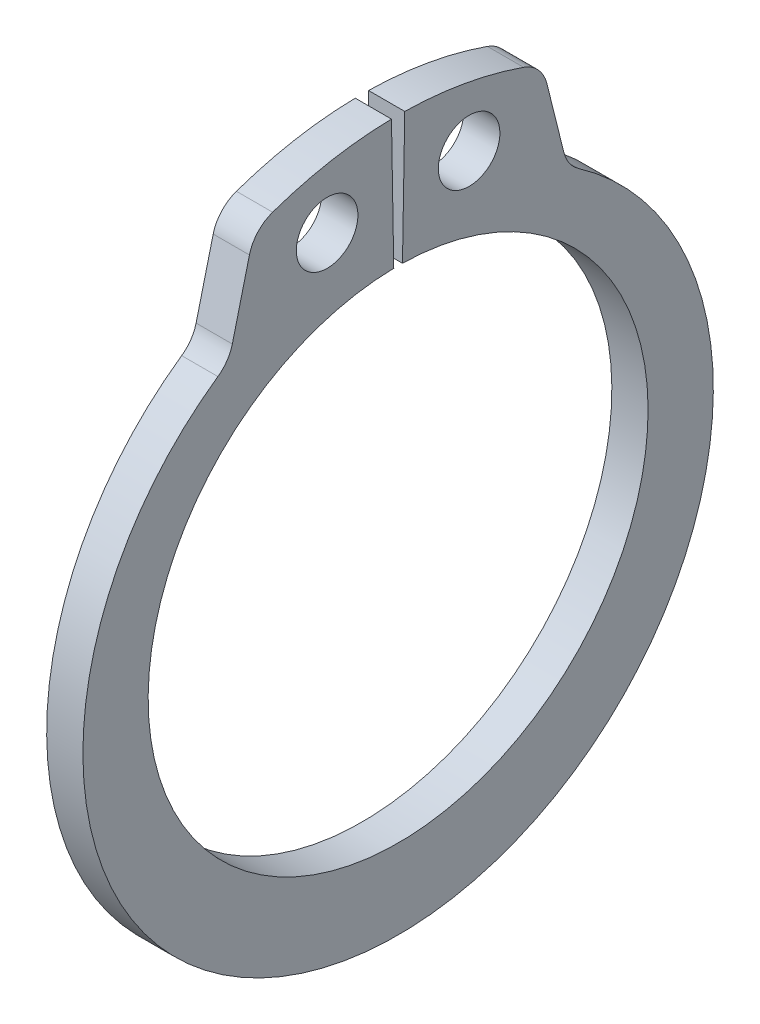
ISO-10303-21;
HEADER;
FILE_DESCRIPTION(('STEP AP214'),'2;1');
FILE_NAME('part.step','',(''),(''),'','','');
FILE_SCHEMA(('AUTOMOTIVE_DESIGN { 1 0 10303 214 1 1 1 1 }'));
ENDSEC;
DATA;
#1=APPLICATION_CONTEXT('core data for automotive mechanical design processes');
#2=APPLICATION_PROTOCOL_DEFINITION('international standard','automotive_design',2000,#1);
#3=PRODUCT_CONTEXT('',#1,'mechanical');
#4=PRODUCT('Part','Part','',(#3));
#5=PRODUCT_RELATED_PRODUCT_CATEGORY('part','',(#4));
#6=PRODUCT_DEFINITION_FORMATION('','',#4);
#7=PRODUCT_DEFINITION_CONTEXT('part definition',#1,'design');
#8=PRODUCT_DEFINITION('design','',#6,#7);
#9=PRODUCT_DEFINITION_SHAPE('','',#8);
#10=(LENGTH_UNIT() NAMED_UNIT(*) SI_UNIT(.MILLI.,.METRE.));
#11=(NAMED_UNIT(*) PLANE_ANGLE_UNIT() SI_UNIT($,.RADIAN.));
#12=(NAMED_UNIT(*) SI_UNIT($,.STERADIAN.) SOLID_ANGLE_UNIT());
#13=UNCERTAINTY_MEASURE_WITH_UNIT(LENGTH_MEASURE(1.E-05),#10,'distance_accuracy_value','');
#14=(GEOMETRIC_REPRESENTATION_CONTEXT(3) GLOBAL_UNCERTAINTY_ASSIGNED_CONTEXT((#13)) GLOBAL_UNIT_ASSIGNED_CONTEXT((#10,
#11,#12)) REPRESENTATION_CONTEXT('',''));
#15=CARTESIAN_POINT('',(0.,0.,0.));
#16=DIRECTION('',(0.,0.,1.));
#17=DIRECTION('',(1.,0.,0.));
#18=AXIS2_PLACEMENT_3D('',#15,#16,#17);
#19=CARTESIAN_POINT('',(-0.5,0.,0.));
#20=DIRECTION('',(1.,0.,0.));
#21=DIRECTION('',(0.,1.,0.));
#22=AXIS2_PLACEMENT_3D('',#19,#20,#21);
#23=PLANE('',#22);
#24=CARTESIAN_POINT('',(-0.5,8.66711980549087,-1.9596288316201));
#25=DIRECTION('',(-1.,0.,0.));
#26=DIRECTION('',(0.,-1.,0.));
#27=AXIS2_PLACEMENT_3D('',#24,#25,#26);
#28=CIRCLE('',#27,0.850000000000001);
#29=CARTESIAN_POINT('',(-0.5,7.81711980549087,-1.9596288316201));
#30=VERTEX_POINT('',#29);
#31=EDGE_CURVE('E125',#30,#30,#28,.F.);
#32=ORIENTED_EDGE('',*,*,#31,.T.);
#33=EDGE_LOOP('',(#32));
#34=FACE_BOUND('',#33,.T.);
#35=CARTESIAN_POINT('',(-0.5,8.96816184312503,3.13401869099665));
#36=DIRECTION('',(-1.,0.,0.));
#37=DIRECTION('',(0.,-1.,0.));
#38=AXIS2_PLACEMENT_3D('',#35,#36,#37);
#39=CIRCLE('',#38,1.);
#40=CARTESIAN_POINT('',(-0.5,9.91217887924345,3.46391539531209));
#41=VERTEX_POINT('',#40);
#42=CARTESIAN_POINT('',(-0.5,9.21008373872469,4.10431441727265));
#43=VERTEX_POINT('',#42);
#44=EDGE_CURVE('E111',#41,#43,#39,.F.);
#45=ORIENTED_EDGE('',*,*,#44,.F.);
#46=CARTESIAN_POINT('',(-0.5,0.,0.));
#47=DIRECTION('',(-1.,0.,0.));
#48=DIRECTION('',(0.,-1.,0.));
#49=AXIS2_PLACEMENT_3D('',#46,#47,#48);
#50=CIRCLE('',#49,10.5);
#51=CARTESIAN_POINT('',(-0.5,10.4984007991421,0.183250267591477));
#52=VERTEX_POINT('',#51);
#53=EDGE_CURVE('E104',#52,#41,#50,.F.);
#54=ORIENTED_EDGE('',*,*,#53,.F.);
#55=DIRECTION('',(0.,-0.999847695156391,-0.0174524064372836));
#56=VECTOR('',#55,1.);
#57=CARTESIAN_POINT('',(-0.5,6.8989490965791,0.120421604417256));
#58=LINE('',#57,#56);
#59=CARTESIAN_POINT('',(-0.5,6.8989490965791,0.120421604417256));
#60=VERTEX_POINT('',#59);
#61=EDGE_CURVE('E108',#52,#60,#58,.T.);
#62=ORIENTED_EDGE('',*,*,#61,.T.);
#63=CARTESIAN_POINT('',(-0.5,0.,0.));
#64=DIRECTION('',(-1.,0.,0.));
#65=DIRECTION('',(0.,-1.,0.));
#66=AXIS2_PLACEMENT_3D('',#63,#64,#65);
#67=CIRCLE('',#66,6.9);
#68=CARTESIAN_POINT('',(-0.5,6.8989490965791,-0.120421604417255));
#69=VERTEX_POINT('',#68);
#70=EDGE_CURVE('E171',#60,#69,#67,.F.);
#71=ORIENTED_EDGE('',*,*,#70,.T.);
#72=DIRECTION('',(0.,0.999847695156391,-0.017452406437284));
#73=VECTOR('',#72,1.);
#74=CARTESIAN_POINT('',(-0.5,10.4984007991421,-0.183250267591479));
#75=LINE('',#74,#73);
#76=CARTESIAN_POINT('',(-0.5,10.4984007991421,-0.183250267591479));
#77=VERTEX_POINT('',#76);
#78=EDGE_CURVE('E133',#69,#77,#75,.T.);
#79=ORIENTED_EDGE('',*,*,#78,.T.);
#80=CARTESIAN_POINT('',(-0.5,0.,0.));
#81=DIRECTION('',(-1.,0.,0.));
#82=DIRECTION('',(0.,-1.,0.));
#83=AXIS2_PLACEMENT_3D('',#80,#81,#82);
#84=CIRCLE('',#83,10.5);
#85=CARTESIAN_POINT('',(-0.5,9.91217887924345,-3.4639153953121));
#86=VERTEX_POINT('',#85);
#87=EDGE_CURVE('E173',#86,#77,#84,.F.);
#88=ORIENTED_EDGE('',*,*,#87,.F.);
#89=CARTESIAN_POINT('',(-0.5,8.96816184312503,-3.13401869099666));
#90=DIRECTION('',(-1.,0.,0.));
#91=DIRECTION('',(0.,-1.,0.));
#92=AXIS2_PLACEMENT_3D('',#89,#90,#91);
#93=CIRCLE('',#92,1.);
#94=CARTESIAN_POINT('',(-0.5,9.21008373872469,-4.10431441727266));
#95=VERTEX_POINT('',#94);
#96=EDGE_CURVE('E176',#95,#86,#93,.F.);
#97=ORIENTED_EDGE('',*,*,#96,.F.);
#98=DIRECTION('',(0.,-0.970295726275997,-0.241921895599666));
#99=VECTOR('',#98,1.);
#100=CARTESIAN_POINT('',(-0.500000000000001,9.7173447274592,-3.97784004803122));
#101=LINE('',#100,#99);
#102=CARTESIAN_POINT('',(-0.5,7.31761530924591,-4.57615979123836));
#103=VERTEX_POINT('',#102);
#104=EDGE_CURVE('E138',#95,#103,#101,.T.);
#105=ORIENTED_EDGE('',*,*,#104,.T.);
#106=CARTESIAN_POINT('',(-0.5,7.55953720484558,-5.54645551751437));
#107=DIRECTION('',(-1.,0.,0.));
#108=DIRECTION('',(0.,-1.,0.));
#109=AXIS2_PLACEMENT_3D('',#106,#107,#108);
#110=CIRCLE('',#109,1.);
#111=CARTESIAN_POINT('',(-0.5,6.73911195964234,-4.97470170945254));
#112=VERTEX_POINT('',#111);
#113=EDGE_CURVE('E178',#103,#112,#110,.F.);
#114=ORIENTED_EDGE('',*,*,#113,.T.);
#115=CARTESIAN_POINT('',(-0.5,-0.399224177769539,0.));
#116=DIRECTION('',(-1.,0.,0.));
#117=DIRECTION('',(0.,-1.,0.));
#118=AXIS2_PLACEMENT_3D('',#115,#116,#117);
#119=CIRCLE('',#118,8.70077582223047);
#120=CARTESIAN_POINT('',(-0.5,6.73911195964234,4.97470170945253));
#121=VERTEX_POINT('',#120);
#122=EDGE_CURVE('E181',#121,#112,#119,.F.);
#123=ORIENTED_EDGE('',*,*,#122,.F.);
#124=CARTESIAN_POINT('',(-0.5,7.55953720484558,5.54645551751436));
#125=DIRECTION('',(-1.,0.,0.));
#126=DIRECTION('',(0.,-1.,0.));
#127=AXIS2_PLACEMENT_3D('',#124,#125,#126);
#128=CIRCLE('',#127,1.);
#129=CARTESIAN_POINT('',(-0.5,7.31761530924592,4.57615979123836));
#130=VERTEX_POINT('',#129);
#131=EDGE_CURVE('E144',#121,#130,#128,.F.);
#132=ORIENTED_EDGE('',*,*,#131,.T.);
#133=DIRECTION('',(0.,0.970295726275997,-0.241921895599665));
#134=VECTOR('',#133,1.);
#135=CARTESIAN_POINT('',(-0.5,9.7173447274592,3.97784004803122));
#136=LINE('',#135,#134);
#137=EDGE_CURVE('E143',#130,#43,#136,.T.);
#138=ORIENTED_EDGE('',*,*,#137,.T.);
#139=EDGE_LOOP('',(#45,#54,#62,#71,#79,#88,#97,#105,#114,#123,#132,#138));
#140=FACE_BOUND('',#139,.T.);
#141=CARTESIAN_POINT('',(-0.5,8.66711980549087,1.9596288316201));
#142=DIRECTION('',(-1.,0.,0.));
#143=DIRECTION('',(0.,-1.,0.));
#144=AXIS2_PLACEMENT_3D('',#141,#142,#143);
#145=CIRCLE('',#144,0.850000000000001);
#146=CARTESIAN_POINT('',(-0.5,7.81711980549087,1.9596288316201));
#147=VERTEX_POINT('',#146);
#148=EDGE_CURVE('E19',#147,#147,#145,.F.);
#149=ORIENTED_EDGE('',*,*,#148,.T.);
#150=EDGE_LOOP('',(#149));
#151=FACE_BOUND('',#150,.T.);
#152=ADVANCED_FACE('F16',(#34,#140,#151),#23,.F.);
#153=CARTESIAN_POINT('',(0.5,8.66711980549087,1.9596288316201));
#154=DIRECTION('',(-1.,0.,0.));
#155=DIRECTION('',(0.,-1.,0.));
#156=AXIS2_PLACEMENT_3D('',#153,#154,#155);
#157=CYLINDRICAL_SURFACE('',#156,0.850000000000001);
#158=CARTESIAN_POINT('',(0.5,8.66711980549087,1.9596288316201));
#159=DIRECTION('',(-1.,0.,0.));
#160=DIRECTION('',(0.,-1.,0.));
#161=AXIS2_PLACEMENT_3D('',#158,#159,#160);
#162=CIRCLE('',#161,0.850000000000001);
#163=CARTESIAN_POINT('',(0.5,7.81711980549087,1.9596288316201));
#164=VERTEX_POINT('',#163);
#165=EDGE_CURVE('E128',#164,#164,#162,.T.);
#166=ORIENTED_EDGE('',*,*,#165,.F.);
#167=EDGE_LOOP('',(#166));
#168=FACE_BOUND('',#167,.T.);
#169=ORIENTED_EDGE('',*,*,#148,.F.);
#170=EDGE_LOOP('',(#169));
#171=FACE_BOUND('',#170,.T.);
#172=ADVANCED_FACE('F271',(#168,#171),#157,.F.);
#173=CARTESIAN_POINT('',(0.5,0.,0.));
#174=DIRECTION('',(-1.,0.,0.));
#175=DIRECTION('',(0.,-1.,0.));
#176=AXIS2_PLACEMENT_3D('',#173,#174,#175);
#177=CYLINDRICAL_SURFACE('',#176,10.5);
#178=CARTESIAN_POINT('',(0.5,0.,0.));
#179=DIRECTION('',(-1.,0.,0.));
#180=DIRECTION('',(0.,-1.,0.));
#181=AXIS2_PLACEMENT_3D('',#178,#179,#180);
#182=CIRCLE('',#181,10.5);
#183=CARTESIAN_POINT('',(0.5,10.4984007991421,0.183250267591477));
#184=VERTEX_POINT('',#183);
#185=CARTESIAN_POINT('',(0.5,9.91217887924345,3.46391539531209));
#186=VERTEX_POINT('',#185);
#187=EDGE_CURVE('E119',#184,#186,#182,.F.);
#188=ORIENTED_EDGE('',*,*,#187,.F.);
#189=DIRECTION('',(1.,0.,0.));
#190=VECTOR('',#189,1.);
#191=CARTESIAN_POINT('',(0.5,10.4984007991421,0.183250267591477));
#192=LINE('',#191,#190);
#193=EDGE_CURVE('E116',#184,#52,#192,.F.);
#194=ORIENTED_EDGE('',*,*,#193,.T.);
#195=ORIENTED_EDGE('',*,*,#53,.T.);
#196=DIRECTION('',(-1.,0.,0.));
#197=VECTOR('',#196,1.);
#198=CARTESIAN_POINT('',(0.5,9.91217887924345,3.46391539531209));
#199=LINE('',#198,#197);
#200=EDGE_CURVE('E114',#186,#41,#199,.T.);
#201=ORIENTED_EDGE('',*,*,#200,.F.);
#202=EDGE_LOOP('',(#188,#194,#195,#201));
#203=FACE_BOUND('',#202,.T.);
#204=ADVANCED_FACE('F117',(#203),#177,.T.);
#205=CARTESIAN_POINT('',(0.5,8.96816184312503,3.13401869099665));
#206=DIRECTION('',(-1.,0.,0.));
#207=DIRECTION('',(0.,-1.,0.));
#208=AXIS2_PLACEMENT_3D('',#205,#206,#207);
#209=CYLINDRICAL_SURFACE('',#208,1.);
#210=ORIENTED_EDGE('',*,*,#44,.T.);
#211=DIRECTION('',(1.,0.,0.));
#212=VECTOR('',#211,1.);
#213=CARTESIAN_POINT('',(0.5,9.21008373872469,4.10431441727265));
#214=LINE('',#213,#212);
#215=CARTESIAN_POINT('',(0.5,9.21008373872469,4.10431441727265));
#216=VERTEX_POINT('',#215);
#217=EDGE_CURVE('E145',#43,#216,#214,.T.);
#218=ORIENTED_EDGE('',*,*,#217,.T.);
#219=CARTESIAN_POINT('',(0.5,8.96816184312503,3.13401869099665));
#220=DIRECTION('',(-1.,0.,0.));
#221=DIRECTION('',(0.,-1.,0.));
#222=AXIS2_PLACEMENT_3D('',#219,#220,#221);
#223=CIRCLE('',#222,1.);
#224=EDGE_CURVE('E165',#186,#216,#223,.F.);
#225=ORIENTED_EDGE('',*,*,#224,.F.);
#226=ORIENTED_EDGE('',*,*,#200,.T.);
#227=EDGE_LOOP('',(#210,#218,#225,#226));
#228=FACE_BOUND('',#227,.T.);
#229=ADVANCED_FACE('F189',(#228),#209,.T.);
#230=CARTESIAN_POINT('',(0.5,9.7173447274592,3.97784004803122));
#231=DIRECTION('',(0.,-0.241921895599665,-0.970295726275997));
#232=DIRECTION('',(0.,0.970295726275997,-0.241921895599665));
#233=AXIS2_PLACEMENT_3D('',#230,#231,#232);
#234=PLANE('',#233);
#235=DIRECTION('',(-1.,0.,0.));
#236=VECTOR('',#235,1.);
#237=CARTESIAN_POINT('',(0.5,7.31761530924592,4.57615979123836));
#238=LINE('',#237,#236);
#239=CARTESIAN_POINT('',(0.5,7.31761530924592,4.57615979123836));
#240=VERTEX_POINT('',#239);
#241=EDGE_CURVE('E186',#130,#240,#238,.F.);
#242=ORIENTED_EDGE('',*,*,#241,.T.);
#243=DIRECTION('',(0.,-0.970295726275997,0.241921895599666));
#244=VECTOR('',#243,1.);
#245=CARTESIAN_POINT('',(0.5,9.21008373872469,4.10431441727265));
#246=LINE('',#245,#244);
#247=EDGE_CURVE('E164',#216,#240,#246,.T.);
#248=ORIENTED_EDGE('',*,*,#247,.F.);
#249=ORIENTED_EDGE('',*,*,#217,.F.);
#250=ORIENTED_EDGE('',*,*,#137,.F.);
#251=EDGE_LOOP('',(#242,#248,#249,#250));
#252=FACE_BOUND('',#251,.T.);
#253=ADVANCED_FACE('F217',(#252),#234,.F.);
#254=CARTESIAN_POINT('',(0.5,7.55953720484558,5.54645551751436));
#255=DIRECTION('',(-1.,0.,0.));
#256=DIRECTION('',(0.,-1.,0.));
#257=AXIS2_PLACEMENT_3D('',#254,#255,#256);
#258=CYLINDRICAL_SURFACE('',#257,1.);
#259=ORIENTED_EDGE('',*,*,#241,.F.);
#260=ORIENTED_EDGE('',*,*,#131,.F.);
#261=DIRECTION('',(-1.,0.,0.));
#262=VECTOR('',#261,1.);
#263=CARTESIAN_POINT('',(0.5,6.73911195964234,4.97470170945253));
#264=LINE('',#263,#262);
#265=CARTESIAN_POINT('',(0.5,6.73911195964234,4.97470170945253));
#266=VERTEX_POINT('',#265);
#267=EDGE_CURVE('E184',#266,#121,#264,.T.);
#268=ORIENTED_EDGE('',*,*,#267,.F.);
#269=CARTESIAN_POINT('',(0.5,7.55953720484558,5.54645551751436));
#270=DIRECTION('',(-1.,0.,0.));
#271=DIRECTION('',(0.,-1.,0.));
#272=AXIS2_PLACEMENT_3D('',#269,#270,#271);
#273=CIRCLE('',#272,1.);
#274=EDGE_CURVE('E161',#240,#266,#273,.T.);
#275=ORIENTED_EDGE('',*,*,#274,.F.);
#276=EDGE_LOOP('',(#259,#260,#268,#275));
#277=FACE_BOUND('',#276,.T.);
#278=ADVANCED_FACE('F220',(#277),#258,.F.);
#279=CARTESIAN_POINT('',(0.5,-0.399224177769539,0.));
#280=DIRECTION('',(-1.,0.,0.));
#281=DIRECTION('',(0.,-1.,0.));
#282=AXIS2_PLACEMENT_3D('',#279,#280,#281);
#283=CYLINDRICAL_SURFACE('',#282,8.70077582223047);
#284=ORIENTED_EDGE('',*,*,#122,.T.);
#285=DIRECTION('',(-1.,0.,0.));
#286=VECTOR('',#285,1.);
#287=CARTESIAN_POINT('',(0.5,6.73911195964234,-4.97470170945254));
#288=LINE('',#287,#286);
#289=CARTESIAN_POINT('',(0.5,6.73911195964234,-4.97470170945254));
#290=VERTEX_POINT('',#289);
#291=EDGE_CURVE('E180',#112,#290,#288,.F.);
#292=ORIENTED_EDGE('',*,*,#291,.T.);
#293=CARTESIAN_POINT('',(0.5,-0.399224177769539,0.));
#294=DIRECTION('',(-1.,0.,0.));
#295=DIRECTION('',(0.,-1.,0.));
#296=AXIS2_PLACEMENT_3D('',#293,#294,#295);
#297=CIRCLE('',#296,8.70077582223047);
#298=EDGE_CURVE('E159',#266,#290,#297,.F.);
#299=ORIENTED_EDGE('',*,*,#298,.F.);
#300=ORIENTED_EDGE('',*,*,#267,.T.);
#301=EDGE_LOOP('',(#284,#292,#299,#300));
#302=FACE_BOUND('',#301,.T.);
#303=ADVANCED_FACE('F225',(#302),#283,.T.);
#304=CARTESIAN_POINT('',(0.5,7.55953720484558,-5.54645551751437));
#305=DIRECTION('',(-1.,0.,0.));
#306=DIRECTION('',(0.,-1.,0.));
#307=AXIS2_PLACEMENT_3D('',#304,#305,#306);
#308=CYLINDRICAL_SURFACE('',#307,1.);
#309=ORIENTED_EDGE('',*,*,#291,.F.);
#310=ORIENTED_EDGE('',*,*,#113,.F.);
#311=DIRECTION('',(1.,0.,0.));
#312=VECTOR('',#311,1.);
#313=CARTESIAN_POINT('',(0.5,7.31761530924591,-4.57615979123837));
#314=LINE('',#313,#312);
#315=CARTESIAN_POINT('',(0.5,7.31761530924591,-4.57615979123837));
#316=VERTEX_POINT('',#315);
#317=EDGE_CURVE('E142',#103,#316,#314,.T.);
#318=ORIENTED_EDGE('',*,*,#317,.T.);
#319=CARTESIAN_POINT('',(0.5,7.55953720484558,-5.54645551751437));
#320=DIRECTION('',(-1.,0.,0.));
#321=DIRECTION('',(0.,-1.,0.));
#322=AXIS2_PLACEMENT_3D('',#319,#320,#321);
#323=CIRCLE('',#322,1.);
#324=EDGE_CURVE('E156',#290,#316,#323,.T.);
#325=ORIENTED_EDGE('',*,*,#324,.F.);
#326=EDGE_LOOP('',(#309,#310,#318,#325));
#327=FACE_BOUND('',#326,.T.);
#328=ADVANCED_FACE('F227',(#327),#308,.F.);
#329=CARTESIAN_POINT('',(0.5,9.7173447274592,-3.97784004803122));
#330=DIRECTION('',(0.,-0.241921895599666,0.970295726275997));
#331=DIRECTION('',(0.,-0.970295726275997,-0.241921895599666));
#332=AXIS2_PLACEMENT_3D('',#329,#330,#331);
#333=PLANE('',#332);
#334=DIRECTION('',(-1.,0.,0.));
#335=VECTOR('',#334,1.);
#336=CARTESIAN_POINT('',(0.5,9.21008373872469,-4.10431441727266));
#337=LINE('',#336,#335);
#338=CARTESIAN_POINT('',(0.5,9.21008373872469,-4.10431441727266));
#339=VERTEX_POINT('',#338);
#340=EDGE_CURVE('E141',#339,#95,#337,.T.);
#341=ORIENTED_EDGE('',*,*,#340,.F.);
#342=DIRECTION('',(0.,0.970295726275997,0.241921895599666));
#343=VECTOR('',#342,1.);
#344=CARTESIAN_POINT('',(0.5,7.31761530924591,-4.57615979123837));
#345=LINE('',#344,#343);
#346=EDGE_CURVE('E155',#316,#339,#345,.T.);
#347=ORIENTED_EDGE('',*,*,#346,.F.);
#348=ORIENTED_EDGE('',*,*,#317,.F.);
#349=ORIENTED_EDGE('',*,*,#104,.F.);
#350=EDGE_LOOP('',(#341,#347,#348,#349));
#351=FACE_BOUND('',#350,.T.);
#352=ADVANCED_FACE('F231',(#351),#333,.F.);
#353=CARTESIAN_POINT('',(0.5,8.96816184312503,-3.13401869099666));
#354=DIRECTION('',(-1.,0.,0.));
#355=DIRECTION('',(0.,-1.,0.));
#356=AXIS2_PLACEMENT_3D('',#353,#354,#355);
#357=CYLINDRICAL_SURFACE('',#356,1.);
#358=ORIENTED_EDGE('',*,*,#96,.T.);
#359=DIRECTION('',(-1.,0.,0.));
#360=VECTOR('',#359,1.);
#361=CARTESIAN_POINT('',(0.5,9.91217887924345,-3.46391539531209));
#362=LINE('',#361,#360);
#363=CARTESIAN_POINT('',(0.5,9.91217887924345,-3.46391539531209));
#364=VERTEX_POINT('',#363);
#365=EDGE_CURVE('E175',#364,#86,#362,.T.);
#366=ORIENTED_EDGE('',*,*,#365,.F.);
#367=CARTESIAN_POINT('',(0.5,8.96816184312503,-3.13401869099666));
#368=DIRECTION('',(-1.,0.,0.));
#369=DIRECTION('',(0.,-1.,0.));
#370=AXIS2_PLACEMENT_3D('',#367,#368,#369);
#371=CIRCLE('',#370,1.);
#372=EDGE_CURVE('E152',#339,#364,#371,.F.);
#373=ORIENTED_EDGE('',*,*,#372,.F.);
#374=ORIENTED_EDGE('',*,*,#340,.T.);
#375=EDGE_LOOP('',(#358,#366,#373,#374));
#376=FACE_BOUND('',#375,.T.);
#377=ADVANCED_FACE('F235',(#376),#357,.T.);
#378=CARTESIAN_POINT('',(0.5,0.,0.));
#379=DIRECTION('',(-1.,0.,0.));
#380=DIRECTION('',(0.,-1.,0.));
#381=AXIS2_PLACEMENT_3D('',#378,#379,#380);
#382=CYLINDRICAL_SURFACE('',#381,10.5);
#383=ORIENTED_EDGE('',*,*,#87,.T.);
#384=DIRECTION('',(1.,0.,0.));
#385=VECTOR('',#384,1.);
#386=CARTESIAN_POINT('',(0.5,10.4984007991421,-0.183250267591479));
#387=LINE('',#386,#385);
#388=CARTESIAN_POINT('',(0.5,10.4984007991421,-0.183250267591479));
#389=VERTEX_POINT('',#388);
#390=EDGE_CURVE('E137',#77,#389,#387,.T.);
#391=ORIENTED_EDGE('',*,*,#390,.T.);
#392=CARTESIAN_POINT('',(0.5,0.,0.));
#393=DIRECTION('',(-1.,0.,0.));
#394=DIRECTION('',(0.,-1.,0.));
#395=AXIS2_PLACEMENT_3D('',#392,#393,#394);
#396=CIRCLE('',#395,10.5);
#397=EDGE_CURVE('E149',#364,#389,#396,.F.);
#398=ORIENTED_EDGE('',*,*,#397,.F.);
#399=ORIENTED_EDGE('',*,*,#365,.T.);
#400=EDGE_LOOP('',(#383,#391,#398,#399));
#401=FACE_BOUND('',#400,.T.);
#402=ADVANCED_FACE('F239',(#401),#382,.T.);
#403=CARTESIAN_POINT('',(0.5,10.4984007991421,-0.183250267591479));
#404=DIRECTION('',(0.,-0.017452406437284,-0.999847695156391));
#405=DIRECTION('',(0.,0.999847695156391,-0.017452406437284));
#406=AXIS2_PLACEMENT_3D('',#403,#404,#405);
#407=PLANE('',#406);
#408=DIRECTION('',(-1.,0.,0.));
#409=VECTOR('',#408,1.);
#410=CARTESIAN_POINT('',(0.5,6.8989490965791,-0.120421604417254));
#411=LINE('',#410,#409);
#412=CARTESIAN_POINT('',(0.5,6.8989490965791,-0.120421604417255));
#413=VERTEX_POINT('',#412);
#414=EDGE_CURVE('E136',#69,#413,#411,.F.);
#415=ORIENTED_EDGE('',*,*,#414,.T.);
#416=DIRECTION('',(0.,-0.999847695156391,0.017452406437284));
#417=VECTOR('',#416,1.);
#418=CARTESIAN_POINT('',(0.5,10.4984007991421,-0.183250267591479));
#419=LINE('',#418,#417);
#420=EDGE_CURVE('E148',#389,#413,#419,.T.);
#421=ORIENTED_EDGE('',*,*,#420,.F.);
#422=ORIENTED_EDGE('',*,*,#390,.F.);
#423=ORIENTED_EDGE('',*,*,#78,.F.);
#424=EDGE_LOOP('',(#415,#421,#422,#423));
#425=FACE_BOUND('',#424,.T.);
#426=ADVANCED_FACE('F244',(#425),#407,.F.);
#427=CARTESIAN_POINT('',(0.5,0.,0.));
#428=DIRECTION('',(-1.,0.,0.));
#429=DIRECTION('',(0.,-1.,0.));
#430=AXIS2_PLACEMENT_3D('',#427,#428,#429);
#431=CYLINDRICAL_SURFACE('',#430,6.9);
#432=DIRECTION('',(1.,0.,0.));
#433=VECTOR('',#432,1.);
#434=CARTESIAN_POINT('',(0.5,6.8989490965791,0.120421604417256));
#435=LINE('',#434,#433);
#436=CARTESIAN_POINT('',(0.5,6.8989490965791,0.120421604417256));
#437=VERTEX_POINT('',#436);
#438=EDGE_CURVE('E122',#60,#437,#435,.T.);
#439=ORIENTED_EDGE('',*,*,#438,.T.);
#440=CARTESIAN_POINT('',(0.5,0.,0.));
#441=DIRECTION('',(-1.,0.,0.));
#442=DIRECTION('',(0.,-1.,0.));
#443=AXIS2_PLACEMENT_3D('',#440,#441,#442);
#444=CIRCLE('',#443,6.9);
#445=EDGE_CURVE('E34',#413,#437,#444,.T.);
#446=ORIENTED_EDGE('',*,*,#445,.F.);
#447=ORIENTED_EDGE('',*,*,#414,.F.);
#448=ORIENTED_EDGE('',*,*,#70,.F.);
#449=EDGE_LOOP('',(#439,#446,#447,#448));
#450=FACE_BOUND('',#449,.T.);
#451=ADVANCED_FACE('F247',(#450),#431,.F.);
#452=CARTESIAN_POINT('',(0.5,6.8989490965791,0.120421604417256));
#453=DIRECTION('',(0.,-0.0174524064372836,0.999847695156391));
#454=DIRECTION('',(0.,-0.999847695156391,-0.0174524064372836));
#455=AXIS2_PLACEMENT_3D('',#452,#453,#454);
#456=PLANE('',#455);
#457=ORIENTED_EDGE('',*,*,#193,.F.);
#458=DIRECTION('',(0.,0.999847695156391,0.0174524064372837));
#459=VECTOR('',#458,1.);
#460=CARTESIAN_POINT('',(0.5,6.8989490965791,0.120421604417256));
#461=LINE('',#460,#459);
#462=EDGE_CURVE('E25',#437,#184,#461,.T.);
#463=ORIENTED_EDGE('',*,*,#462,.F.);
#464=ORIENTED_EDGE('',*,*,#438,.F.);
#465=ORIENTED_EDGE('',*,*,#61,.F.);
#466=EDGE_LOOP('',(#457,#463,#464,#465));
#467=FACE_BOUND('',#466,.T.);
#468=ADVANCED_FACE('F124',(#467),#456,.F.);
#469=CARTESIAN_POINT('',(0.5,8.66711980549087,-1.9596288316201));
#470=DIRECTION('',(-1.,0.,0.));
#471=DIRECTION('',(0.,-1.,0.));
#472=AXIS2_PLACEMENT_3D('',#469,#470,#471);
#473=CYLINDRICAL_SURFACE('',#472,0.850000000000001);
#474=CARTESIAN_POINT('',(0.5,8.66711980549087,-1.9596288316201));
#475=DIRECTION('',(-1.,0.,0.));
#476=DIRECTION('',(0.,-1.,0.));
#477=AXIS2_PLACEMENT_3D('',#474,#475,#476);
#478=CIRCLE('',#477,0.850000000000001);
#479=CARTESIAN_POINT('',(0.5,7.81711980549087,-1.9596288316201));
#480=VERTEX_POINT('',#479);
#481=EDGE_CURVE('E11',#480,#480,#478,.T.);
#482=ORIENTED_EDGE('',*,*,#481,.F.);
#483=EDGE_LOOP('',(#482));
#484=FACE_BOUND('',#483,.T.);
#485=ORIENTED_EDGE('',*,*,#31,.F.);
#486=EDGE_LOOP('',(#485));
#487=FACE_BOUND('',#486,.T.);
#488=ADVANCED_FACE('F255',(#484,#487),#473,.F.);
#489=CARTESIAN_POINT('',(0.5,0.,0.));
#490=DIRECTION('',(1.,0.,0.));
#491=DIRECTION('',(0.,1.,0.));
#492=AXIS2_PLACEMENT_3D('',#489,#490,#491);
#493=PLANE('',#492);
#494=ORIENTED_EDGE('',*,*,#481,.T.);
#495=EDGE_LOOP('',(#494));
#496=FACE_BOUND('',#495,.T.);
#497=ORIENTED_EDGE('',*,*,#445,.T.);
#498=ORIENTED_EDGE('',*,*,#462,.T.);
#499=ORIENTED_EDGE('',*,*,#187,.T.);
#500=ORIENTED_EDGE('',*,*,#224,.T.);
#501=ORIENTED_EDGE('',*,*,#247,.T.);
#502=ORIENTED_EDGE('',*,*,#274,.T.);
#503=ORIENTED_EDGE('',*,*,#298,.T.);
#504=ORIENTED_EDGE('',*,*,#324,.T.);
#505=ORIENTED_EDGE('',*,*,#346,.T.);
#506=ORIENTED_EDGE('',*,*,#372,.T.);
#507=ORIENTED_EDGE('',*,*,#397,.T.);
#508=ORIENTED_EDGE('',*,*,#420,.T.);
#509=EDGE_LOOP('',(#497,#498,#499,#500,#501,#502,#503,#504,#505,#506,#507,#508));
#510=FACE_BOUND('',#509,.T.);
#511=ORIENTED_EDGE('',*,*,#165,.T.);
#512=EDGE_LOOP('',(#511));
#513=FACE_BOUND('',#512,.T.);
#514=ADVANCED_FACE('F193',(#496,#510,#513),#493,.T.);
#515=CLOSED_SHELL('',(#152,#172,#204,#229,#253,#278,#303,#328,#352,#377,#402,#426,#451,#468,
#488,#514));
#516=MANIFOLD_SOLID_BREP('B1',#515);
#517=ADVANCED_BREP_SHAPE_REPRESENTATION('',(#18,#516),#14);
#518=SHAPE_DEFINITION_REPRESENTATION(#9,#517);
ENDSEC;
END-ISO-10303-21;
